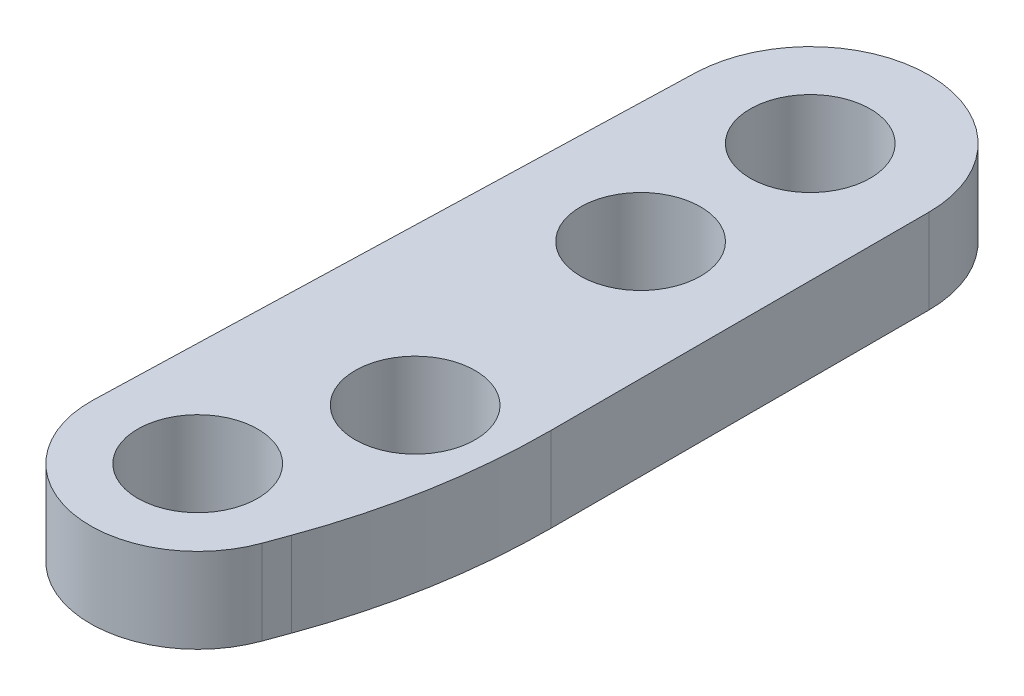
ISO-10303-21;
HEADER;
FILE_DESCRIPTION(('STEP AP214'),'2;1');
FILE_NAME('part.step','',(''),(''),'','','');
FILE_SCHEMA(('AUTOMOTIVE_DESIGN { 1 0 10303 214 1 1 1 1 }'));
ENDSEC;
DATA;
#1=APPLICATION_CONTEXT('core data for automotive mechanical design processes');
#2=APPLICATION_PROTOCOL_DEFINITION('international standard','automotive_design',2000,#1);
#3=PRODUCT_CONTEXT('',#1,'mechanical');
#4=PRODUCT('Part','Part','',(#3));
#5=PRODUCT_RELATED_PRODUCT_CATEGORY('part','',(#4));
#6=PRODUCT_DEFINITION_FORMATION('','',#4);
#7=PRODUCT_DEFINITION_CONTEXT('part definition',#1,'design');
#8=PRODUCT_DEFINITION('design','',#6,#7);
#9=PRODUCT_DEFINITION_SHAPE('','',#8);
#10=(LENGTH_UNIT() NAMED_UNIT(*) SI_UNIT(.MILLI.,.METRE.));
#11=(NAMED_UNIT(*) PLANE_ANGLE_UNIT() SI_UNIT($,.RADIAN.));
#12=(NAMED_UNIT(*) SI_UNIT($,.STERADIAN.) SOLID_ANGLE_UNIT());
#13=UNCERTAINTY_MEASURE_WITH_UNIT(LENGTH_MEASURE(1.E-05),#10,'distance_accuracy_value','');
#14=(GEOMETRIC_REPRESENTATION_CONTEXT(3) GLOBAL_UNCERTAINTY_ASSIGNED_CONTEXT((#13)) GLOBAL_UNIT_ASSIGNED_CONTEXT((#10,
#11,#12)) REPRESENTATION_CONTEXT('',''));
#15=CARTESIAN_POINT('',(0.,0.,0.));
#16=DIRECTION('',(0.,0.,1.));
#17=DIRECTION('',(1.,0.,0.));
#18=AXIS2_PLACEMENT_3D('',#15,#16,#17);
#19=CARTESIAN_POINT('',(0.,3.175,0.));
#20=DIRECTION('',(0.,-1.,0.));
#21=DIRECTION('',(0.,0.,-1.));
#22=AXIS2_PLACEMENT_3D('',#19,#20,#21);
#23=CYLINDRICAL_SURFACE('',#22,4.02166666666667);
#24=CARTESIAN_POINT('',(0.,0.,0.));
#25=DIRECTION('',(0.,1.,0.));
#26=DIRECTION('',(0.,0.,1.));
#27=AXIS2_PLACEMENT_3D('',#24,#25,#26);
#28=CIRCLE('',#27,4.02166666666667);
#29=CARTESIAN_POINT('',(-4.01981862305763,0.,-0.121905764821993));
#30=VERTEX_POINT('',#29);
#31=CARTESIAN_POINT('',(3.77913048992733,0.,1.37549100974139));
#32=VERTEX_POINT('',#31);
#33=EDGE_CURVE('E119',#30,#32,#28,.T.);
#34=ORIENTED_EDGE('',*,*,#33,.T.);
#35=DIRECTION('',(0.,-1.,0.));
#36=VECTOR('',#35,1.);
#37=CARTESIAN_POINT('',(3.77913048992733,3.175,1.37549100974139));
#38=LINE('',#37,#36);
#39=CARTESIAN_POINT('',(3.77913048992733,3.175,1.37549100974139));
#40=VERTEX_POINT('',#39);
#41=EDGE_CURVE('E11',#40,#32,#38,.T.);
#42=ORIENTED_EDGE('',*,*,#41,.F.);
#43=CARTESIAN_POINT('',(0.,3.175,0.));
#44=DIRECTION('',(0.,1.,0.));
#45=DIRECTION('',(0.,0.,1.));
#46=AXIS2_PLACEMENT_3D('',#43,#44,#45);
#47=CIRCLE('',#46,4.02166666666667);
#48=CARTESIAN_POINT('',(-4.01981862305763,3.175,-0.121905764821993));
#49=VERTEX_POINT('',#48);
#50=EDGE_CURVE('E130',#49,#40,#47,.T.);
#51=ORIENTED_EDGE('',*,*,#50,.F.);
#52=DIRECTION('',(0.,-1.,0.));
#53=VECTOR('',#52,1.);
#54=CARTESIAN_POINT('',(-4.01981862305763,3.175,-0.121905764821993));
#55=LINE('',#54,#53);
#56=EDGE_CURVE('E115',#49,#30,#55,.T.);
#57=ORIENTED_EDGE('',*,*,#56,.T.);
#58=EDGE_LOOP('',(#34,#42,#51,#57));
#59=FACE_BOUND('',#58,.T.);
#60=ADVANCED_FACE('F33',(#59),#23,.T.);
#61=CARTESIAN_POINT('',(3.77913048992733,3.175,1.37549100974139));
#62=DIRECTION('',(-0.939692620785909,0.,-0.342020143325666));
#63=DIRECTION('',(-0.342020143325666,0.,0.939692620785909));
#64=AXIS2_PLACEMENT_3D('',#61,#62,#63);
#65=PLANE('',#64);
#66=DIRECTION('',(0.342020143325666,0.,-0.939692620785909));
#67=VECTOR('',#66,1.);
#68=CARTESIAN_POINT('',(3.77913048992733,0.,1.37549100974139));
#69=LINE('',#68,#67);
#70=CARTESIAN_POINT('',(4.07682791011798,0.,0.557574069937691));
#71=VERTEX_POINT('',#70);
#72=EDGE_CURVE('E122',#32,#71,#69,.T.);
#73=ORIENTED_EDGE('',*,*,#72,.T.);
#74=DIRECTION('',(0.,-1.,0.));
#75=VECTOR('',#74,1.);
#76=CARTESIAN_POINT('',(4.07682791011798,3.175,0.557574069937691));
#77=LINE('',#76,#75);
#78=CARTESIAN_POINT('',(4.07682791011798,3.175,0.557574069937691));
#79=VERTEX_POINT('',#78);
#80=EDGE_CURVE('E42',#79,#71,#77,.T.);
#81=ORIENTED_EDGE('',*,*,#80,.F.);
#82=DIRECTION('',(0.342020143325666,0.,-0.939692620785909));
#83=VECTOR('',#82,1.);
#84=CARTESIAN_POINT('',(3.77913048992733,3.175,1.37549100974139));
#85=LINE('',#84,#83);
#86=EDGE_CURVE('E88',#40,#79,#85,.T.);
#87=ORIENTED_EDGE('',*,*,#86,.F.);
#88=ORIENTED_EDGE('',*,*,#41,.T.);
#89=EDGE_LOOP('',(#73,#81,#87,#88));
#90=FACE_BOUND('',#89,.T.);
#91=ADVANCED_FACE('F162',(#90),#65,.F.);
#92=CARTESIAN_POINT('',(-18.5803318641082,3.175,-7.68895768089411));
#93=DIRECTION('',(0.,-1.,0.));
#94=DIRECTION('',(0.,0.,-1.));
#95=AXIS2_PLACEMENT_3D('',#92,#93,#94);
#96=CYLINDRICAL_SURFACE('',#95,24.1112458191669);
#97=CARTESIAN_POINT('',(-18.5803318641082,0.,-7.68895768089411));
#98=DIRECTION('',(0.,1.,0.));
#99=DIRECTION('',(0.,0.,1.));
#100=AXIS2_PLACEMENT_3D('',#97,#98,#99);
#101=CIRCLE('',#100,24.1112458191669);
#102=CARTESIAN_POINT('',(5.53091395505862,0.,-7.68895768089412));
#103=VERTEX_POINT('',#102);
#104=EDGE_CURVE('E125',#71,#103,#101,.T.);
#105=ORIENTED_EDGE('',*,*,#104,.T.);
#106=DIRECTION('',(0.,-1.,0.));
#107=VECTOR('',#106,1.);
#108=CARTESIAN_POINT('',(5.53091395505862,3.175,-7.68895768089412));
#109=LINE('',#108,#107);
#110=CARTESIAN_POINT('',(5.53091395505862,3.175,-7.68895768089412));
#111=VERTEX_POINT('',#110);
#112=EDGE_CURVE('E110',#111,#103,#109,.T.);
#113=ORIENTED_EDGE('',*,*,#112,.F.);
#114=CARTESIAN_POINT('',(-18.5803318641082,3.175,-7.68895768089411));
#115=DIRECTION('',(0.,1.,0.));
#116=DIRECTION('',(0.,0.,1.));
#117=AXIS2_PLACEMENT_3D('',#114,#115,#116);
#118=CIRCLE('',#117,24.1112458191669);
#119=EDGE_CURVE('E101',#79,#111,#118,.T.);
#120=ORIENTED_EDGE('',*,*,#119,.F.);
#121=ORIENTED_EDGE('',*,*,#80,.T.);
#122=EDGE_LOOP('',(#105,#113,#120,#121));
#123=FACE_BOUND('',#122,.T.);
#124=ADVANCED_FACE('F165',(#123),#96,.T.);
#125=CARTESIAN_POINT('',(5.53091395505862,3.175,-21.8420481419905));
#126=DIRECTION('',(-1.,0.,0.));
#127=DIRECTION('',(0.,0.,1.));
#128=AXIS2_PLACEMENT_3D('',#125,#126,#127);
#129=PLANE('',#128);
#130=DIRECTION('',(0.,0.,-1.));
#131=VECTOR('',#130,1.);
#132=CARTESIAN_POINT('',(5.53091395505862,0.,-21.8420481419905));
#133=LINE('',#132,#131);
#134=CARTESIAN_POINT('',(5.53091395505873,0.,-21.8420481419905));
#135=VERTEX_POINT('',#134);
#136=EDGE_CURVE('E109',#103,#135,#133,.T.);
#137=ORIENTED_EDGE('',*,*,#136,.T.);
#138=DIRECTION('',(0.,-1.,0.));
#139=VECTOR('',#138,1.);
#140=CARTESIAN_POINT('',(5.53091395505873,3.175,-21.8420481419905));
#141=LINE('',#140,#139);
#142=CARTESIAN_POINT('',(5.53091395505873,3.175,-21.8420481419905));
#143=VERTEX_POINT('',#142);
#144=EDGE_CURVE('E106',#143,#135,#141,.T.);
#145=ORIENTED_EDGE('',*,*,#144,.F.);
#146=DIRECTION('',(0.,0.,-1.));
#147=VECTOR('',#146,1.);
#148=CARTESIAN_POINT('',(5.53091395505862,3.175,-21.8420481419905));
#149=LINE('',#148,#147);
#150=EDGE_CURVE('E95',#111,#143,#149,.T.);
#151=ORIENTED_EDGE('',*,*,#150,.F.);
#152=ORIENTED_EDGE('',*,*,#112,.T.);
#153=EDGE_LOOP('',(#137,#145,#151,#152));
#154=FACE_BOUND('',#153,.T.);
#155=ADVANCED_FACE('F107',(#154),#129,.F.);
#156=CARTESIAN_POINT('',(1.08591395505884,3.175,-21.8420481419905));
#157=DIRECTION('',(0.,-1.,0.));
#158=DIRECTION('',(0.,0.,-1.));
#159=AXIS2_PLACEMENT_3D('',#156,#157,#158);
#160=CYLINDRICAL_SURFACE('',#159,4.44499999999989);
#161=CARTESIAN_POINT('',(1.08591395505884,0.,-21.8420481419905));
#162=DIRECTION('',(0.,1.,0.));
#163=DIRECTION('',(0.,0.,-1.));
#164=AXIS2_PLACEMENT_3D('',#161,#162,#163);
#165=CIRCLE('',#164,4.44499999999989);
#166=CARTESIAN_POINT('',(-3.35704347042591,0.,-21.9767860925833));
#167=VERTEX_POINT('',#166);
#168=EDGE_CURVE('E74',#135,#167,#165,.T.);
#169=ORIENTED_EDGE('',*,*,#168,.T.);
#170=DIRECTION('',(0.,-1.,0.));
#171=VECTOR('',#170,1.);
#172=CARTESIAN_POINT('',(-3.35704347042591,3.175,-21.9767860925833));
#173=LINE('',#172,#171);
#174=CARTESIAN_POINT('',(-3.35704347042591,3.175,-21.9767860925833));
#175=VERTEX_POINT('',#174);
#176=EDGE_CURVE('E111',#175,#167,#173,.T.);
#177=ORIENTED_EDGE('',*,*,#176,.F.);
#178=CARTESIAN_POINT('',(1.08591395505884,3.175,-21.8420481419905));
#179=DIRECTION('',(0.,1.,0.));
#180=DIRECTION('',(0.,0.,-1.));
#181=AXIS2_PLACEMENT_3D('',#178,#179,#180);
#182=CIRCLE('',#181,4.44499999999989);
#183=EDGE_CURVE('E99',#143,#175,#182,.T.);
#184=ORIENTED_EDGE('',*,*,#183,.F.);
#185=ORIENTED_EDGE('',*,*,#144,.T.);
#186=EDGE_LOOP('',(#169,#177,#184,#185));
#187=FACE_BOUND('',#186,.T.);
#188=ADVANCED_FACE('F113',(#187),#160,.T.);
#189=CARTESIAN_POINT('',(-4.01981862305763,3.175,-0.121905764821993));
#190=DIRECTION('',(0.999540478174297,0.,0.0303122498521325));
#191=DIRECTION('',(0.0303122498521325,0.,-0.999540478174297));
#192=AXIS2_PLACEMENT_3D('',#189,#190,#191);
#193=PLANE('',#192);
#194=DIRECTION('',(-0.0303122498521325,0.,0.999540478174297));
#195=VECTOR('',#194,1.);
#196=CARTESIAN_POINT('',(-4.01981862305763,0.,-0.121905764821993));
#197=LINE('',#196,#195);
#198=EDGE_CURVE('E80',#167,#30,#197,.T.);
#199=ORIENTED_EDGE('',*,*,#198,.T.);
#200=ORIENTED_EDGE('',*,*,#56,.F.);
#201=DIRECTION('',(-0.0303122498521325,0.,0.999540478174297));
#202=VECTOR('',#201,1.);
#203=CARTESIAN_POINT('',(-4.01981862305763,3.175,-0.121905764821993));
#204=LINE('',#203,#202);
#205=EDGE_CURVE('E51',#175,#49,#204,.T.);
#206=ORIENTED_EDGE('',*,*,#205,.F.);
#207=ORIENTED_EDGE('',*,*,#176,.T.);
#208=EDGE_LOOP('',(#199,#200,#206,#207));
#209=FACE_BOUND('',#208,.T.);
#210=ADVANCED_FACE('F170',(#209),#193,.F.);
#211=CARTESIAN_POINT('',(0.,3.175,0.));
#212=DIRECTION('',(0.,1.,0.));
#213=DIRECTION('',(0.,0.,1.));
#214=AXIS2_PLACEMENT_3D('',#211,#212,#213);
#215=PLANE('',#214);
#216=CARTESIAN_POINT('',(1.0859139550587,3.175,-21.8420481419905));
#217=DIRECTION('',(0.,1.,0.));
#218=DIRECTION('',(0.,0.,1.));
#219=AXIS2_PLACEMENT_3D('',#216,#217,#218);
#220=CIRCLE('',#219,2.24789999999999);
#221=CARTESIAN_POINT('',(1.0859139550587,3.175,-19.5941481419905));
#222=VERTEX_POINT('',#221);
#223=EDGE_CURVE('E152',#222,#222,#220,.T.);
#224=ORIENTED_EDGE('',*,*,#223,.F.);
#225=EDGE_LOOP('',(#224));
#226=FACE_BOUND('',#225,.T.);
#227=CARTESIAN_POINT('',(1.08591395505872,3.175,-15.4920481419905));
#228=DIRECTION('',(0.,1.,0.));
#229=DIRECTION('',(0.,0.,1.));
#230=AXIS2_PLACEMENT_3D('',#227,#228,#229);
#231=CIRCLE('',#230,2.24789999999999);
#232=CARTESIAN_POINT('',(1.08591395505872,3.175,-13.2441481419905));
#233=VERTEX_POINT('',#232);
#234=EDGE_CURVE('E141',#233,#233,#231,.T.);
#235=ORIENTED_EDGE('',*,*,#234,.F.);
#236=EDGE_LOOP('',(#235));
#237=FACE_BOUND('',#236,.T.);
#238=CARTESIAN_POINT('',(2.17182791011798,3.175,-5.96704814199053));
#239=DIRECTION('',(0.,1.,0.));
#240=DIRECTION('',(0.,0.,1.));
#241=AXIS2_PLACEMENT_3D('',#238,#239,#240);
#242=CIRCLE('',#241,2.2479);
#243=CARTESIAN_POINT('',(2.17182791011798,3.175,-3.71914814199053));
#244=VERTEX_POINT('',#243);
#245=EDGE_CURVE('E140',#244,#244,#242,.T.);
#246=ORIENTED_EDGE('',*,*,#245,.F.);
#247=EDGE_LOOP('',(#246));
#248=FACE_BOUND('',#247,.T.);
#249=CARTESIAN_POINT('',(0.,3.175,0.));
#250=DIRECTION('',(0.,1.,0.));
#251=DIRECTION('',(0.,0.,1.));
#252=AXIS2_PLACEMENT_3D('',#249,#250,#251);
#253=CIRCLE('',#252,2.2479);
#254=CARTESIAN_POINT('',(0.,3.175,2.2479));
#255=VERTEX_POINT('',#254);
#256=EDGE_CURVE('E137',#255,#255,#253,.T.);
#257=ORIENTED_EDGE('',*,*,#256,.F.);
#258=EDGE_LOOP('',(#257));
#259=FACE_BOUND('',#258,.T.);
#260=ORIENTED_EDGE('',*,*,#50,.T.);
#261=ORIENTED_EDGE('',*,*,#86,.T.);
#262=ORIENTED_EDGE('',*,*,#119,.T.);
#263=ORIENTED_EDGE('',*,*,#150,.T.);
#264=ORIENTED_EDGE('',*,*,#183,.T.);
#265=ORIENTED_EDGE('',*,*,#205,.T.);
#266=EDGE_LOOP('',(#260,#261,#262,#263,#264,#265));
#267=FACE_BOUND('',#266,.T.);
#268=ADVANCED_FACE('F97',(#226,#237,#248,#259,#267),#215,.T.);
#269=CARTESIAN_POINT('',(0.,0.,0.));
#270=DIRECTION('',(0.,1.,0.));
#271=DIRECTION('',(0.,0.,1.));
#272=AXIS2_PLACEMENT_3D('',#269,#270,#271);
#273=PLANE('',#272);
#274=CARTESIAN_POINT('',(1.0859139550587,0.,-21.8420481419905));
#275=DIRECTION('',(0.,1.,0.));
#276=DIRECTION('',(0.,0.,1.));
#277=AXIS2_PLACEMENT_3D('',#274,#275,#276);
#278=CIRCLE('',#277,2.24789999999999);
#279=CARTESIAN_POINT('',(1.0859139550587,0.,-19.5941481419905));
#280=VERTEX_POINT('',#279);
#281=EDGE_CURVE('E36',#280,#280,#278,.T.);
#282=ORIENTED_EDGE('',*,*,#281,.T.);
#283=EDGE_LOOP('',(#282));
#284=FACE_BOUND('',#283,.T.);
#285=CARTESIAN_POINT('',(1.08591395505872,0.,-15.4920481419905));
#286=DIRECTION('',(0.,1.,0.));
#287=DIRECTION('',(0.,0.,1.));
#288=AXIS2_PLACEMENT_3D('',#285,#286,#287);
#289=CIRCLE('',#288,2.24789999999999);
#290=CARTESIAN_POINT('',(1.08591395505872,0.,-13.2441481419905));
#291=VERTEX_POINT('',#290);
#292=EDGE_CURVE('E138',#291,#291,#289,.T.);
#293=ORIENTED_EDGE('',*,*,#292,.T.);
#294=EDGE_LOOP('',(#293));
#295=FACE_BOUND('',#294,.T.);
#296=CARTESIAN_POINT('',(2.17182791011798,0.,-5.96704814199053));
#297=DIRECTION('',(0.,1.,0.));
#298=DIRECTION('',(0.,0.,1.));
#299=AXIS2_PLACEMENT_3D('',#296,#297,#298);
#300=CIRCLE('',#299,2.24789999999999);
#301=CARTESIAN_POINT('',(2.17182791011798,0.,-3.71914814199053));
#302=VERTEX_POINT('',#301);
#303=EDGE_CURVE('E145',#302,#302,#300,.T.);
#304=ORIENTED_EDGE('',*,*,#303,.T.);
#305=EDGE_LOOP('',(#304));
#306=FACE_BOUND('',#305,.T.);
#307=CARTESIAN_POINT('',(0.,0.,0.));
#308=DIRECTION('',(0.,1.,0.));
#309=DIRECTION('',(0.,0.,1.));
#310=AXIS2_PLACEMENT_3D('',#307,#308,#309);
#311=CIRCLE('',#310,2.24789999999999);
#312=CARTESIAN_POINT('',(0.,0.,2.24789999999999));
#313=VERTEX_POINT('',#312);
#314=EDGE_CURVE('E123',#313,#313,#311,.T.);
#315=ORIENTED_EDGE('',*,*,#314,.T.);
#316=EDGE_LOOP('',(#315));
#317=FACE_BOUND('',#316,.T.);
#318=ORIENTED_EDGE('',*,*,#33,.F.);
#319=ORIENTED_EDGE('',*,*,#198,.F.);
#320=ORIENTED_EDGE('',*,*,#168,.F.);
#321=ORIENTED_EDGE('',*,*,#136,.F.);
#322=ORIENTED_EDGE('',*,*,#104,.F.);
#323=ORIENTED_EDGE('',*,*,#72,.F.);
#324=EDGE_LOOP('',(#318,#319,#320,#321,#322,#323));
#325=FACE_BOUND('',#324,.T.);
#326=ADVANCED_FACE('F168',(#284,#295,#306,#317,#325),#273,.F.);
#327=CARTESIAN_POINT('',(0.,3.175,0.));
#328=DIRECTION('',(0.,1.,0.));
#329=DIRECTION('',(0.,0.,1.));
#330=AXIS2_PLACEMENT_3D('',#327,#328,#329);
#331=CYLINDRICAL_SURFACE('',#330,2.24789999999999);
#332=ORIENTED_EDGE('',*,*,#256,.T.);
#333=EDGE_LOOP('',(#332));
#334=FACE_BOUND('',#333,.T.);
#335=ORIENTED_EDGE('',*,*,#314,.F.);
#336=EDGE_LOOP('',(#335));
#337=FACE_BOUND('',#336,.T.);
#338=ADVANCED_FACE('F209',(#334,#337),#331,.F.);
#339=CARTESIAN_POINT('',(2.17182791011798,3.175,-5.96704814199053));
#340=DIRECTION('',(0.,1.,0.));
#341=DIRECTION('',(0.,0.,1.));
#342=AXIS2_PLACEMENT_3D('',#339,#340,#341);
#343=CYLINDRICAL_SURFACE('',#342,2.24789999999999);
#344=ORIENTED_EDGE('',*,*,#245,.T.);
#345=EDGE_LOOP('',(#344));
#346=FACE_BOUND('',#345,.T.);
#347=ORIENTED_EDGE('',*,*,#303,.F.);
#348=EDGE_LOOP('',(#347));
#349=FACE_BOUND('',#348,.T.);
#350=ADVANCED_FACE('F214',(#346,#349),#343,.F.);
#351=CARTESIAN_POINT('',(1.08591395505872,3.175,-15.4920481419905));
#352=DIRECTION('',(0.,1.,0.));
#353=DIRECTION('',(0.,0.,1.));
#354=AXIS2_PLACEMENT_3D('',#351,#352,#353);
#355=CYLINDRICAL_SURFACE('',#354,2.24789999999999);
#356=ORIENTED_EDGE('',*,*,#234,.T.);
#357=EDGE_LOOP('',(#356));
#358=FACE_BOUND('',#357,.T.);
#359=ORIENTED_EDGE('',*,*,#292,.F.);
#360=EDGE_LOOP('',(#359));
#361=FACE_BOUND('',#360,.T.);
#362=ADVANCED_FACE('F226',(#358,#361),#355,.F.);
#363=CARTESIAN_POINT('',(1.0859139550587,3.175,-21.8420481419905));
#364=DIRECTION('',(0.,1.,0.));
#365=DIRECTION('',(0.,0.,1.));
#366=AXIS2_PLACEMENT_3D('',#363,#364,#365);
#367=CYLINDRICAL_SURFACE('',#366,2.24789999999999);
#368=ORIENTED_EDGE('',*,*,#223,.T.);
#369=EDGE_LOOP('',(#368));
#370=FACE_BOUND('',#369,.T.);
#371=ORIENTED_EDGE('',*,*,#281,.F.);
#372=EDGE_LOOP('',(#371));
#373=FACE_BOUND('',#372,.T.);
#374=ADVANCED_FACE('F247',(#370,#373),#367,.F.);
#375=CLOSED_SHELL('',(#60,#91,#124,#155,#188,#210,#268,#326,#338,#350,#362,#374));
#376=MANIFOLD_SOLID_BREP('B2',#375);
#377=ADVANCED_BREP_SHAPE_REPRESENTATION('',(#18,#376),#14);
#378=SHAPE_DEFINITION_REPRESENTATION(#9,#377);
ENDSEC;
END-ISO-10303-21;
